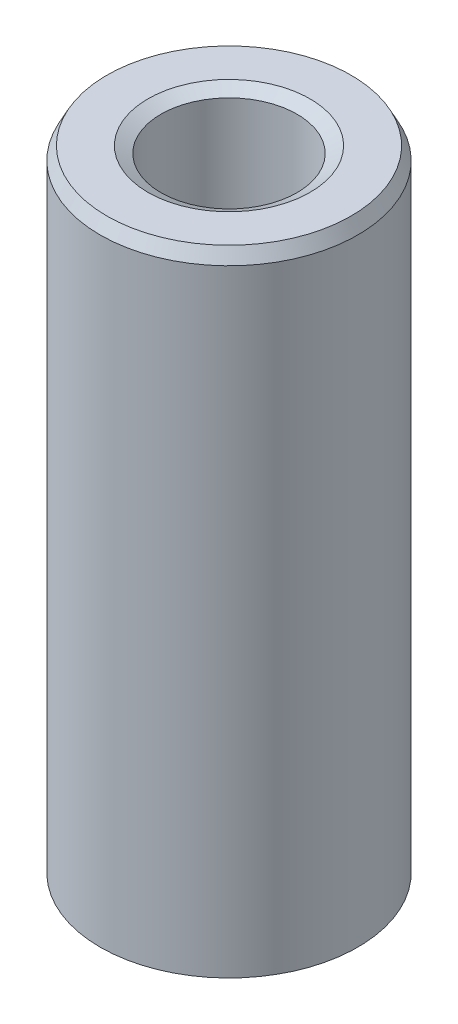
ISO-10303-21;
HEADER;
FILE_DESCRIPTION(('STEP AP214'),'2;1');
FILE_NAME('part.step','',(''),(''),'','','');
FILE_SCHEMA(('AUTOMOTIVE_DESIGN { 1 0 10303 214 1 1 1 1 }'));
ENDSEC;
DATA;
#1=APPLICATION_CONTEXT('core data for automotive mechanical design processes');
#2=APPLICATION_PROTOCOL_DEFINITION('international standard','automotive_design',2000,#1);
#3=PRODUCT_CONTEXT('',#1,'mechanical');
#4=PRODUCT('Part','Part','',(#3));
#5=PRODUCT_RELATED_PRODUCT_CATEGORY('part','',(#4));
#6=PRODUCT_DEFINITION_FORMATION('','',#4);
#7=PRODUCT_DEFINITION_CONTEXT('part definition',#1,'design');
#8=PRODUCT_DEFINITION('design','',#6,#7);
#9=PRODUCT_DEFINITION_SHAPE('','',#8);
#10=(LENGTH_UNIT() NAMED_UNIT(*) SI_UNIT(.MILLI.,.METRE.));
#11=(NAMED_UNIT(*) PLANE_ANGLE_UNIT() SI_UNIT($,.RADIAN.));
#12=(NAMED_UNIT(*) SI_UNIT($,.STERADIAN.) SOLID_ANGLE_UNIT());
#13=UNCERTAINTY_MEASURE_WITH_UNIT(LENGTH_MEASURE(1.E-05),#10,'distance_accuracy_value','');
#14=(GEOMETRIC_REPRESENTATION_CONTEXT(3) GLOBAL_UNCERTAINTY_ASSIGNED_CONTEXT((#13)) GLOBAL_UNIT_ASSIGNED_CONTEXT((#10,
#11,#12)) REPRESENTATION_CONTEXT('',''));
#15=CARTESIAN_POINT('',(0.,0.,0.));
#16=DIRECTION('',(0.,0.,1.));
#17=DIRECTION('',(1.,0.,0.));
#18=AXIS2_PLACEMENT_3D('',#15,#16,#17);
#19=CARTESIAN_POINT('',(0.,24.7066326284266,0.));
#20=DIRECTION('',(0.,-1.,0.));
#21=DIRECTION('',(0.,0.,-1.));
#22=AXIS2_PLACEMENT_3D('',#19,#20,#21);
#23=CYLINDRICAL_SURFACE('',#22,5.);
#24=CARTESIAN_POINT('',(0.,0.262627621659763,0.));
#25=DIRECTION('',(0.,1.,0.));
#26=DIRECTION('',(0.,0.,1.));
#27=AXIS2_PLACEMENT_3D('',#24,#25,#26);
#28=CIRCLE('',#27,5.);
#29=CARTESIAN_POINT('',(0.,0.262627621659763,5.));
#30=VERTEX_POINT('',#29);
#31=EDGE_CURVE('E10',#30,#30,#28,.T.);
#32=ORIENTED_EDGE('',*,*,#31,.T.);
#33=EDGE_LOOP('',(#32));
#34=FACE_BOUND('',#33,.T.);
#35=CARTESIAN_POINT('',(0.,24.2014667475691,0.));
#36=DIRECTION('',(0.,1.,0.));
#37=DIRECTION('',(0.,0.,1.));
#38=AXIS2_PLACEMENT_3D('',#35,#36,#37);
#39=CIRCLE('',#38,5.);
#40=CARTESIAN_POINT('',(0.,24.2014667475691,5.));
#41=VERTEX_POINT('',#40);
#42=EDGE_CURVE('E50',#41,#41,#39,.F.);
#43=ORIENTED_EDGE('',*,*,#42,.T.);
#44=EDGE_LOOP('',(#43));
#45=FACE_BOUND('',#44,.T.);
#46=ADVANCED_FACE('F39',(#34,#45),#23,.T.);
#47=CARTESIAN_POINT('',(0.,24.7066326284266,0.));
#48=DIRECTION('',(0.,1.,0.));
#49=DIRECTION('',(0.,0.,1.));
#50=AXIS2_PLACEMENT_3D('',#47,#48,#49);
#51=PLANE('',#50);
#52=CARTESIAN_POINT('',(0.,24.7066326284266,0.));
#53=DIRECTION('',(0.,1.,0.));
#54=DIRECTION('',(0.,0.,1.));
#55=AXIS2_PLACEMENT_3D('',#52,#53,#54);
#56=CIRCLE('',#55,3.1462127847364);
#57=CARTESIAN_POINT('',(0.,24.7066326284266,3.1462127847364));
#58=VERTEX_POINT('',#57);
#59=EDGE_CURVE('E58',#58,#58,#56,.F.);
#60=ORIENTED_EDGE('',*,*,#59,.T.);
#61=EDGE_LOOP('',(#60));
#62=FACE_BOUND('',#61,.T.);
#63=CARTESIAN_POINT('',(0.,24.7066326284266,0.));
#64=DIRECTION('',(0.,1.,0.));
#65=DIRECTION('',(0.,0.,1.));
#66=AXIS2_PLACEMENT_3D('',#63,#64,#65);
#67=CIRCLE('',#66,4.73737237834024);
#68=CARTESIAN_POINT('',(0.,24.7066326284266,4.73737237834024));
#69=VERTEX_POINT('',#68);
#70=EDGE_CURVE('E61',#69,#69,#67,.T.);
#71=ORIENTED_EDGE('',*,*,#70,.T.);
#72=EDGE_LOOP('',(#71));
#73=FACE_BOUND('',#72,.T.);
#74=ADVANCED_FACE('F88',(#62,#73),#51,.T.);
#75=CARTESIAN_POINT('',(0.,0.,0.));
#76=DIRECTION('',(0.,1.,0.));
#77=DIRECTION('',(0.,0.,1.));
#78=AXIS2_PLACEMENT_3D('',#75,#76,#77);
#79=PLANE('',#78);
#80=CARTESIAN_POINT('',(0.,0.,0.));
#81=DIRECTION('',(0.,1.,0.));
#82=DIRECTION('',(0.,0.,1.));
#83=AXIS2_PLACEMENT_3D('',#80,#81,#82);
#84=CIRCLE('',#83,2.90367452553868);
#85=CARTESIAN_POINT('',(0.,0.,2.90367452553868));
#86=VERTEX_POINT('',#85);
#87=EDGE_CURVE('E51',#86,#86,#84,.T.);
#88=ORIENTED_EDGE('',*,*,#87,.T.);
#89=EDGE_LOOP('',(#88));
#90=FACE_BOUND('',#89,.T.);
#91=CARTESIAN_POINT('',(0.,0.,0.));
#92=DIRECTION('',(0.,1.,0.));
#93=DIRECTION('',(0.,0.,1.));
#94=AXIS2_PLACEMENT_3D('',#91,#92,#93);
#95=CIRCLE('',#94,4.49483411914251);
#96=CARTESIAN_POINT('',(0.,0.,4.49483411914251));
#97=VERTEX_POINT('',#96);
#98=EDGE_CURVE('E54',#97,#97,#95,.F.);
#99=ORIENTED_EDGE('',*,*,#98,.T.);
#100=EDGE_LOOP('',(#99));
#101=FACE_BOUND('',#100,.T.);
#102=ADVANCED_FACE('F83',(#90,#101),#79,.F.);
#103=CARTESIAN_POINT('',(0.,24.7066326284266,0.));
#104=DIRECTION('',(0.,-1.,0.));
#105=DIRECTION('',(0.,0.,-1.));
#106=AXIS2_PLACEMENT_3D('',#103,#104,#105);
#107=CYLINDRICAL_SURFACE('',#106,2.64104690387892);
#108=CARTESIAN_POINT('',(0.,24.4440050067668,0.));
#109=DIRECTION('',(0.,1.,0.));
#110=DIRECTION('',(0.,0.,1.));
#111=AXIS2_PLACEMENT_3D('',#108,#109,#110);
#112=CIRCLE('',#111,2.64104690387892);
#113=CARTESIAN_POINT('',(0.,24.4440050067668,2.64104690387892));
#114=VERTEX_POINT('',#113);
#115=EDGE_CURVE('E67',#114,#114,#112,.T.);
#116=ORIENTED_EDGE('',*,*,#115,.T.);
#117=EDGE_LOOP('',(#116));
#118=FACE_BOUND('',#117,.T.);
#119=CARTESIAN_POINT('',(0.,0.505165880857486,0.));
#120=DIRECTION('',(0.,1.,0.));
#121=DIRECTION('',(0.,0.,1.));
#122=AXIS2_PLACEMENT_3D('',#119,#120,#121);
#123=CIRCLE('',#122,2.64104690387892);
#124=CARTESIAN_POINT('',(0.,0.505165880857486,2.64104690387892));
#125=VERTEX_POINT('',#124);
#126=EDGE_CURVE('E69',#125,#125,#123,.F.);
#127=ORIENTED_EDGE('',*,*,#126,.T.);
#128=EDGE_LOOP('',(#127));
#129=FACE_BOUND('',#128,.T.);
#130=ADVANCED_FACE('F71',(#118,#129),#107,.F.);
#131=CARTESIAN_POINT('',(0.,24.4440050067668,0.));
#132=DIRECTION('',(0.,1.,0.));
#133=DIRECTION('',(0.,0.,1.));
#134=AXIS2_PLACEMENT_3D('',#131,#132,#133);
#135=CONICAL_SURFACE('',#134,2.64104690387892,1.09136840684493);
#136=ORIENTED_EDGE('',*,*,#59,.F.);
#137=EDGE_LOOP('',(#136));
#138=FACE_BOUND('',#137,.T.);
#139=ORIENTED_EDGE('',*,*,#115,.F.);
#140=EDGE_LOOP('',(#139));
#141=FACE_BOUND('',#140,.T.);
#142=ADVANCED_FACE('F77',(#138,#141),#135,.F.);
#143=CARTESIAN_POINT('',(0.,0.,0.));
#144=DIRECTION('',(0.,-1.,0.));
#145=DIRECTION('',(0.,0.,-1.));
#146=AXIS2_PLACEMENT_3D('',#143,#144,#145);
#147=CONICAL_SURFACE('',#146,2.90367452553868,0.479427919949965);
#148=ORIENTED_EDGE('',*,*,#126,.F.);
#149=EDGE_LOOP('',(#148));
#150=FACE_BOUND('',#149,.T.);
#151=ORIENTED_EDGE('',*,*,#87,.F.);
#152=EDGE_LOOP('',(#151));
#153=FACE_BOUND('',#152,.T.);
#154=ADVANCED_FACE('F73',(#150,#153),#147,.F.);
#155=CARTESIAN_POINT('',(0.,0.262627621659763,0.));
#156=DIRECTION('',(0.,1.,0.));
#157=DIRECTION('',(0.,0.,1.));
#158=AXIS2_PLACEMENT_3D('',#155,#156,#157);
#159=CONICAL_SURFACE('',#158,5.,1.09136840684493);
#160=ORIENTED_EDGE('',*,*,#98,.F.);
#161=EDGE_LOOP('',(#160));
#162=FACE_BOUND('',#161,.T.);
#163=ORIENTED_EDGE('',*,*,#31,.F.);
#164=EDGE_LOOP('',(#163));
#165=FACE_BOUND('',#164,.T.);
#166=ADVANCED_FACE('F76',(#162,#165),#159,.T.);
#167=CARTESIAN_POINT('',(0.,24.7066326284266,0.));
#168=DIRECTION('',(0.,-1.,0.));
#169=DIRECTION('',(0.,0.,-1.));
#170=AXIS2_PLACEMENT_3D('',#167,#168,#169);
#171=CONICAL_SURFACE('',#170,4.73737237834024,0.479427919949963);
#172=ORIENTED_EDGE('',*,*,#42,.F.);
#173=EDGE_LOOP('',(#172));
#174=FACE_BOUND('',#173,.T.);
#175=ORIENTED_EDGE('',*,*,#70,.F.);
#176=EDGE_LOOP('',(#175));
#177=FACE_BOUND('',#176,.T.);
#178=ADVANCED_FACE('F45',(#174,#177),#171,.T.);
#179=CLOSED_SHELL('',(#46,#74,#102,#130,#142,#154,#166,#178));
#180=MANIFOLD_SOLID_BREP('B2',#179);
#181=ADVANCED_BREP_SHAPE_REPRESENTATION('',(#18,#180),#14);
#182=SHAPE_DEFINITION_REPRESENTATION(#9,#181);
ENDSEC;
END-ISO-10303-21;
